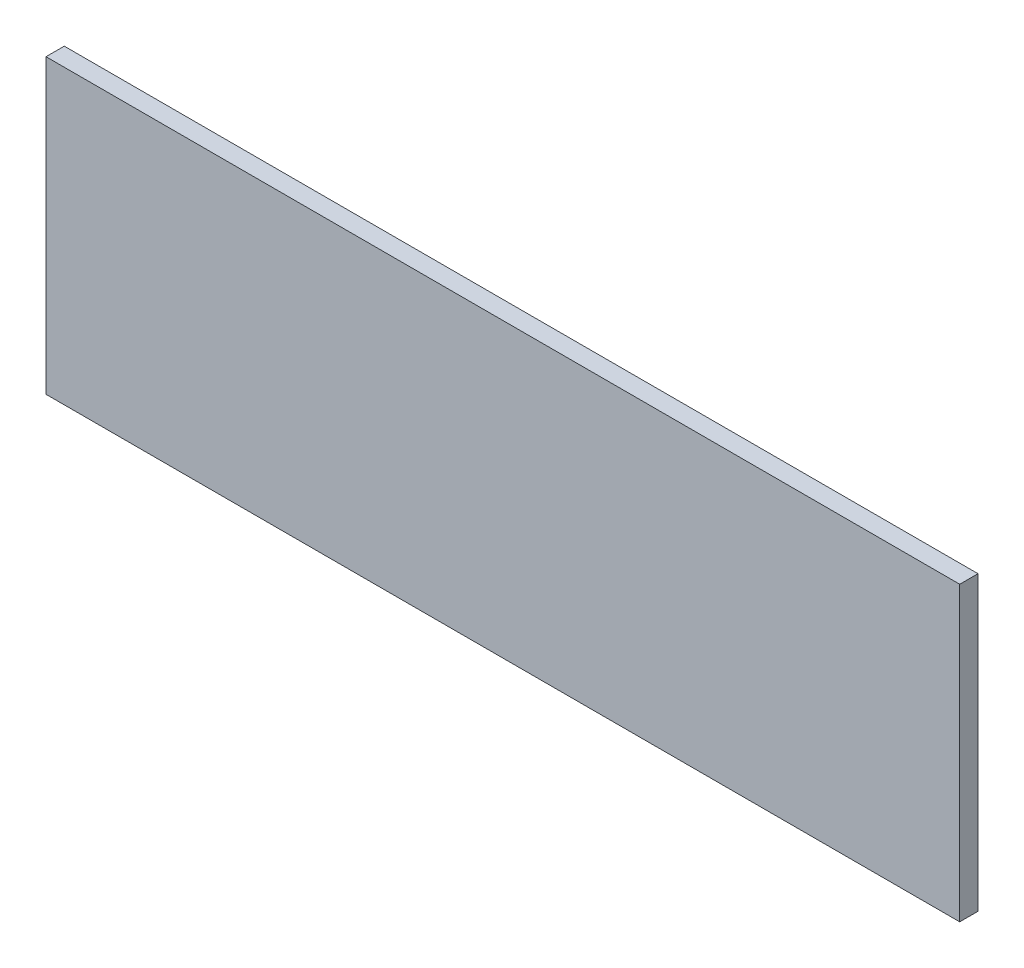
ISO-10303-21;
HEADER;
FILE_DESCRIPTION(('STEP AP214'),'2;1');
FILE_NAME('part.step','',(''),(''),'','','');
FILE_SCHEMA(('AUTOMOTIVE_DESIGN { 1 0 10303 214 1 1 1 1 }'));
ENDSEC;
DATA;
#1=APPLICATION_CONTEXT('core data for automotive mechanical design processes');
#2=APPLICATION_PROTOCOL_DEFINITION('international standard','automotive_design',2000,#1);
#3=PRODUCT_CONTEXT('',#1,'mechanical');
#4=PRODUCT('Part','Part','',(#3));
#5=PRODUCT_RELATED_PRODUCT_CATEGORY('part','',(#4));
#6=PRODUCT_DEFINITION_FORMATION('','',#4);
#7=PRODUCT_DEFINITION_CONTEXT('part definition',#1,'design');
#8=PRODUCT_DEFINITION('design','',#6,#7);
#9=PRODUCT_DEFINITION_SHAPE('','',#8);
#10=(LENGTH_UNIT() NAMED_UNIT(*) SI_UNIT(.MILLI.,.METRE.));
#11=(NAMED_UNIT(*) PLANE_ANGLE_UNIT() SI_UNIT($,.RADIAN.));
#12=(NAMED_UNIT(*) SI_UNIT($,.STERADIAN.) SOLID_ANGLE_UNIT());
#13=UNCERTAINTY_MEASURE_WITH_UNIT(LENGTH_MEASURE(1.E-05),#10,'distance_accuracy_value','');
#14=(GEOMETRIC_REPRESENTATION_CONTEXT(3) GLOBAL_UNCERTAINTY_ASSIGNED_CONTEXT((#13)) GLOBAL_UNIT_ASSIGNED_CONTEXT((#10,
#11,#12)) REPRESENTATION_CONTEXT('',''));
#15=CARTESIAN_POINT('',(0.,0.,0.));
#16=DIRECTION('',(0.,0.,1.));
#17=DIRECTION('',(1.,0.,0.));
#18=AXIS2_PLACEMENT_3D('',#15,#16,#17);
#19=CARTESIAN_POINT('',(317.5,-101.6,12.7));
#20=DIRECTION('',(-1.,0.,0.));
#21=DIRECTION('',(0.,0.,1.));
#22=AXIS2_PLACEMENT_3D('',#19,#20,#21);
#23=PLANE('',#22);
#24=DIRECTION('',(0.,1.,0.));
#25=VECTOR('',#24,1.);
#26=CARTESIAN_POINT('',(317.5,-101.6,0.));
#27=LINE('',#26,#25);
#28=CARTESIAN_POINT('',(317.5,-101.6,0.));
#29=VERTEX_POINT('',#28);
#30=CARTESIAN_POINT('',(317.5,101.6,0.));
#31=VERTEX_POINT('',#30);
#32=EDGE_CURVE('E96',#29,#31,#27,.T.);
#33=ORIENTED_EDGE('',*,*,#32,.T.);
#34=DIRECTION('',(0.,0.,-1.));
#35=VECTOR('',#34,1.);
#36=CARTESIAN_POINT('',(317.5,101.6,12.7));
#37=LINE('',#36,#35);
#38=CARTESIAN_POINT('',(317.5,101.6,12.7));
#39=VERTEX_POINT('',#38);
#40=EDGE_CURVE('E11',#39,#31,#37,.T.);
#41=ORIENTED_EDGE('',*,*,#40,.F.);
#42=DIRECTION('',(0.,1.,0.));
#43=VECTOR('',#42,1.);
#44=CARTESIAN_POINT('',(317.5,-101.6,12.7));
#45=LINE('',#44,#43);
#46=CARTESIAN_POINT('',(317.5,-101.6,12.7));
#47=VERTEX_POINT('',#46);
#48=EDGE_CURVE('E84',#47,#39,#45,.T.);
#49=ORIENTED_EDGE('',*,*,#48,.F.);
#50=DIRECTION('',(0.,0.,-1.));
#51=VECTOR('',#50,1.);
#52=CARTESIAN_POINT('',(317.5,-101.6,12.7));
#53=LINE('',#52,#51);
#54=EDGE_CURVE('E92',#47,#29,#53,.T.);
#55=ORIENTED_EDGE('',*,*,#54,.T.);
#56=EDGE_LOOP('',(#33,#41,#49,#55));
#57=FACE_BOUND('',#56,.T.);
#58=ADVANCED_FACE('F33',(#57),#23,.F.);
#59=CARTESIAN_POINT('',(-317.5,101.6,12.7));
#60=DIRECTION('',(0.,-1.,0.));
#61=DIRECTION('',(0.,0.,-1.));
#62=AXIS2_PLACEMENT_3D('',#59,#60,#61);
#63=PLANE('',#62);
#64=DIRECTION('',(-1.,0.,0.));
#65=VECTOR('',#64,1.);
#66=CARTESIAN_POINT('',(-317.5,101.6,0.));
#67=LINE('',#66,#65);
#68=CARTESIAN_POINT('',(-317.5,101.6,0.));
#69=VERTEX_POINT('',#68);
#70=EDGE_CURVE('E88',#31,#69,#67,.T.);
#71=ORIENTED_EDGE('',*,*,#70,.T.);
#72=DIRECTION('',(0.,0.,-1.));
#73=VECTOR('',#72,1.);
#74=CARTESIAN_POINT('',(-317.5,101.6,12.7));
#75=LINE('',#74,#73);
#76=CARTESIAN_POINT('',(-317.5,101.6,12.7));
#77=VERTEX_POINT('',#76);
#78=EDGE_CURVE('E41',#77,#69,#75,.T.);
#79=ORIENTED_EDGE('',*,*,#78,.F.);
#80=DIRECTION('',(-1.,0.,0.));
#81=VECTOR('',#80,1.);
#82=CARTESIAN_POINT('',(-317.5,101.6,12.7));
#83=LINE('',#82,#81);
#84=EDGE_CURVE('E79',#39,#77,#83,.T.);
#85=ORIENTED_EDGE('',*,*,#84,.F.);
#86=ORIENTED_EDGE('',*,*,#40,.T.);
#87=EDGE_LOOP('',(#71,#79,#85,#86));
#88=FACE_BOUND('',#87,.T.);
#89=ADVANCED_FACE('F87',(#88),#63,.F.);
#90=CARTESIAN_POINT('',(-317.5,-101.6,12.7));
#91=DIRECTION('',(1.,0.,0.));
#92=DIRECTION('',(0.,0.,-1.));
#93=AXIS2_PLACEMENT_3D('',#90,#91,#92);
#94=PLANE('',#93);
#95=DIRECTION('',(0.,-1.,0.));
#96=VECTOR('',#95,1.);
#97=CARTESIAN_POINT('',(-317.5,-101.6,0.));
#98=LINE('',#97,#96);
#99=CARTESIAN_POINT('',(-317.5,-101.6,0.));
#100=VERTEX_POINT('',#99);
#101=EDGE_CURVE('E66',#69,#100,#98,.T.);
#102=ORIENTED_EDGE('',*,*,#101,.T.);
#103=DIRECTION('',(0.,0.,-1.));
#104=VECTOR('',#103,1.);
#105=CARTESIAN_POINT('',(-317.5,-101.6,12.7));
#106=LINE('',#105,#104);
#107=CARTESIAN_POINT('',(-317.5,-101.6,12.7));
#108=VERTEX_POINT('',#107);
#109=EDGE_CURVE('E89',#108,#100,#106,.T.);
#110=ORIENTED_EDGE('',*,*,#109,.F.);
#111=DIRECTION('',(0.,-1.,0.));
#112=VECTOR('',#111,1.);
#113=CARTESIAN_POINT('',(-317.5,-101.6,12.7));
#114=LINE('',#113,#112);
#115=EDGE_CURVE('E82',#77,#108,#114,.T.);
#116=ORIENTED_EDGE('',*,*,#115,.F.);
#117=ORIENTED_EDGE('',*,*,#78,.T.);
#118=EDGE_LOOP('',(#102,#110,#116,#117));
#119=FACE_BOUND('',#118,.T.);
#120=ADVANCED_FACE('F90',(#119),#94,.F.);
#121=CARTESIAN_POINT('',(-317.5,-101.6,12.7));
#122=DIRECTION('',(0.,1.,0.));
#123=DIRECTION('',(0.,0.,1.));
#124=AXIS2_PLACEMENT_3D('',#121,#122,#123);
#125=PLANE('',#124);
#126=DIRECTION('',(1.,0.,0.));
#127=VECTOR('',#126,1.);
#128=CARTESIAN_POINT('',(-317.5,-101.6,0.));
#129=LINE('',#128,#127);
#130=EDGE_CURVE('E72',#100,#29,#129,.T.);
#131=ORIENTED_EDGE('',*,*,#130,.T.);
#132=ORIENTED_EDGE('',*,*,#54,.F.);
#133=DIRECTION('',(1.,0.,0.));
#134=VECTOR('',#133,1.);
#135=CARTESIAN_POINT('',(-317.5,-101.6,12.7));
#136=LINE('',#135,#134);
#137=EDGE_CURVE('E49',#108,#47,#136,.T.);
#138=ORIENTED_EDGE('',*,*,#137,.F.);
#139=ORIENTED_EDGE('',*,*,#109,.T.);
#140=EDGE_LOOP('',(#131,#132,#138,#139));
#141=FACE_BOUND('',#140,.T.);
#142=ADVANCED_FACE('F103',(#141),#125,.F.);
#143=CARTESIAN_POINT('',(0.,0.,12.7));
#144=DIRECTION('',(0.,0.,-1.));
#145=DIRECTION('',(-1.,0.,0.));
#146=AXIS2_PLACEMENT_3D('',#143,#144,#145);
#147=PLANE('',#146);
#148=ORIENTED_EDGE('',*,*,#48,.T.);
#149=ORIENTED_EDGE('',*,*,#84,.T.);
#150=ORIENTED_EDGE('',*,*,#115,.T.);
#151=ORIENTED_EDGE('',*,*,#137,.T.);
#152=EDGE_LOOP('',(#148,#149,#150,#151));
#153=FACE_BOUND('',#152,.T.);
#154=ADVANCED_FACE('F80',(#153),#147,.F.);
#155=CARTESIAN_POINT('',(0.,0.,0.));
#156=DIRECTION('',(0.,0.,-1.));
#157=DIRECTION('',(-1.,0.,0.));
#158=AXIS2_PLACEMENT_3D('',#155,#156,#157);
#159=PLANE('',#158);
#160=ORIENTED_EDGE('',*,*,#32,.F.);
#161=ORIENTED_EDGE('',*,*,#130,.F.);
#162=ORIENTED_EDGE('',*,*,#101,.F.);
#163=ORIENTED_EDGE('',*,*,#70,.F.);
#164=EDGE_LOOP('',(#160,#161,#162,#163));
#165=FACE_BOUND('',#164,.T.);
#166=ADVANCED_FACE('F106',(#165),#159,.T.);
#167=CLOSED_SHELL('',(#58,#89,#120,#142,#154,#166));
#168=MANIFOLD_SOLID_BREP('B2',#167);
#169=ADVANCED_BREP_SHAPE_REPRESENTATION('',(#18,#168),#14);
#170=SHAPE_DEFINITION_REPRESENTATION(#9,#169);
ENDSEC;
END-ISO-10303-21;
